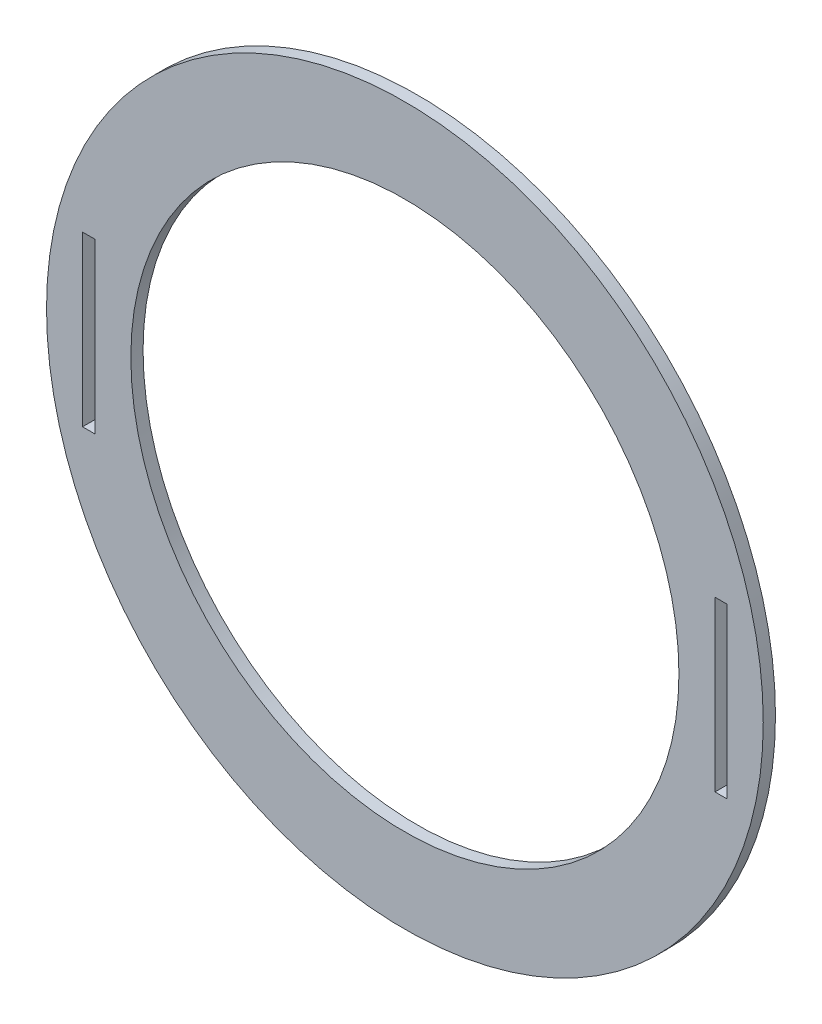
ISO-10303-21;
HEADER;
FILE_DESCRIPTION(('STEP AP214'),'2;1');
FILE_NAME('part.step','',(''),(''),'','','');
FILE_SCHEMA(('AUTOMOTIVE_DESIGN { 1 0 10303 214 1 1 1 1 }'));
ENDSEC;
DATA;
#1=APPLICATION_CONTEXT('core data for automotive mechanical design processes');
#2=APPLICATION_PROTOCOL_DEFINITION('international standard','automotive_design',2000,#1);
#3=PRODUCT_CONTEXT('',#1,'mechanical');
#4=PRODUCT('Part','Part','',(#3));
#5=PRODUCT_RELATED_PRODUCT_CATEGORY('part','',(#4));
#6=PRODUCT_DEFINITION_FORMATION('','',#4);
#7=PRODUCT_DEFINITION_CONTEXT('part definition',#1,'design');
#8=PRODUCT_DEFINITION('design','',#6,#7);
#9=PRODUCT_DEFINITION_SHAPE('','',#8);
#10=(LENGTH_UNIT() NAMED_UNIT(*) SI_UNIT(.MILLI.,.METRE.));
#11=(NAMED_UNIT(*) PLANE_ANGLE_UNIT() SI_UNIT($,.RADIAN.));
#12=(NAMED_UNIT(*) SI_UNIT($,.STERADIAN.) SOLID_ANGLE_UNIT());
#13=UNCERTAINTY_MEASURE_WITH_UNIT(LENGTH_MEASURE(1.E-05),#10,'distance_accuracy_value','');
#14=(GEOMETRIC_REPRESENTATION_CONTEXT(3) GLOBAL_UNCERTAINTY_ASSIGNED_CONTEXT((#13)) GLOBAL_UNIT_ASSIGNED_CONTEXT((#10,
#11,#12)) REPRESENTATION_CONTEXT('',''));
#15=CARTESIAN_POINT('',(0.,0.,0.));
#16=DIRECTION('',(0.,0.,1.));
#17=DIRECTION('',(1.,0.,0.));
#18=AXIS2_PLACEMENT_3D('',#15,#16,#17);
#19=CARTESIAN_POINT('',(0.,0.,2.9));
#20=DIRECTION('',(0.,0.,1.));
#21=DIRECTION('',(1.,0.,0.));
#22=AXIS2_PLACEMENT_3D('',#19,#20,#21);
#23=PLANE('',#22);
#24=CARTESIAN_POINT('',(0.,0.,2.9));
#25=DIRECTION('',(0.,0.,1.));
#26=DIRECTION('',(1.,0.,0.));
#27=AXIS2_PLACEMENT_3D('',#24,#25,#26);
#28=CIRCLE('',#27,85.);
#29=CARTESIAN_POINT('',(85.,0.,2.9));
#30=VERTEX_POINT('',#29);
#31=EDGE_CURVE('E11',#30,#30,#28,.T.);
#32=ORIENTED_EDGE('',*,*,#31,.T.);
#33=EDGE_LOOP('',(#32));
#34=FACE_BOUND('',#33,.T.);
#35=CARTESIAN_POINT('',(0.,0.,2.9));
#36=DIRECTION('',(0.,0.,1.));
#37=DIRECTION('',(1.,0.,0.));
#38=AXIS2_PLACEMENT_3D('',#35,#36,#37);
#39=CIRCLE('',#38,65.);
#40=CARTESIAN_POINT('',(65.,0.,2.9));
#41=VERTEX_POINT('',#40);
#42=EDGE_CURVE('E167',#41,#41,#39,.T.);
#43=ORIENTED_EDGE('',*,*,#42,.F.);
#44=EDGE_LOOP('',(#43));
#45=FACE_BOUND('',#44,.T.);
#46=DIRECTION('',(-1.,0.,0.));
#47=VECTOR('',#46,1.);
#48=CARTESIAN_POINT('',(-76.45,20.,2.9));
#49=LINE('',#48,#47);
#50=CARTESIAN_POINT('',(-73.55,20.,2.9));
#51=VERTEX_POINT('',#50);
#52=CARTESIAN_POINT('',(-76.45,20.,2.9));
#53=VERTEX_POINT('',#52);
#54=EDGE_CURVE('E138',#51,#53,#49,.T.);
#55=ORIENTED_EDGE('',*,*,#54,.F.);
#56=DIRECTION('',(0.,1.,0.));
#57=VECTOR('',#56,1.);
#58=CARTESIAN_POINT('',(-73.55,20.,2.9));
#59=LINE('',#58,#57);
#60=CARTESIAN_POINT('',(-73.55,-20.,2.9));
#61=VERTEX_POINT('',#60);
#62=EDGE_CURVE('E136',#61,#51,#59,.T.);
#63=ORIENTED_EDGE('',*,*,#62,.F.);
#64=DIRECTION('',(1.,0.,0.));
#65=VECTOR('',#64,1.);
#66=CARTESIAN_POINT('',(-76.45,-20.,2.9));
#67=LINE('',#66,#65);
#68=CARTESIAN_POINT('',(-76.45,-20.,2.9));
#69=VERTEX_POINT('',#68);
#70=EDGE_CURVE('E144',#69,#61,#67,.T.);
#71=ORIENTED_EDGE('',*,*,#70,.F.);
#72=DIRECTION('',(0.,-1.,0.));
#73=VECTOR('',#72,1.);
#74=CARTESIAN_POINT('',(-76.45,20.,2.9));
#75=LINE('',#74,#73);
#76=EDGE_CURVE('E141',#53,#69,#75,.T.);
#77=ORIENTED_EDGE('',*,*,#76,.F.);
#78=EDGE_LOOP('',(#55,#63,#71,#77));
#79=FACE_BOUND('',#78,.T.);
#80=DIRECTION('',(-1.,0.,0.));
#81=VECTOR('',#80,1.);
#82=CARTESIAN_POINT('',(76.45,20.,2.9));
#83=LINE('',#82,#81);
#84=CARTESIAN_POINT('',(76.45,20.,2.9));
#85=VERTEX_POINT('',#84);
#86=CARTESIAN_POINT('',(73.55,20.,2.9));
#87=VERTEX_POINT('',#86);
#88=EDGE_CURVE('E108',#85,#87,#83,.T.);
#89=ORIENTED_EDGE('',*,*,#88,.F.);
#90=DIRECTION('',(0.,1.,0.));
#91=VECTOR('',#90,1.);
#92=CARTESIAN_POINT('',(76.45,20.,2.9));
#93=LINE('',#92,#91);
#94=CARTESIAN_POINT('',(76.45,-20.,2.9));
#95=VERTEX_POINT('',#94);
#96=EDGE_CURVE('E100',#95,#85,#93,.T.);
#97=ORIENTED_EDGE('',*,*,#96,.F.);
#98=DIRECTION('',(1.,0.,0.));
#99=VECTOR('',#98,1.);
#100=CARTESIAN_POINT('',(76.45,-20.,2.9));
#101=LINE('',#100,#99);
#102=CARTESIAN_POINT('',(73.55,-20.,2.9));
#103=VERTEX_POINT('',#102);
#104=EDGE_CURVE('E122',#103,#95,#101,.T.);
#105=ORIENTED_EDGE('',*,*,#104,.F.);
#106=DIRECTION('',(0.,-1.,0.));
#107=VECTOR('',#106,1.);
#108=CARTESIAN_POINT('',(73.55,20.,2.9));
#109=LINE('',#108,#107);
#110=EDGE_CURVE('E120',#87,#103,#109,.T.);
#111=ORIENTED_EDGE('',*,*,#110,.F.);
#112=EDGE_LOOP('',(#89,#97,#105,#111));
#113=FACE_BOUND('',#112,.T.);
#114=ADVANCED_FACE('F35',(#34,#45,#79,#113),#23,.T.);
#115=CARTESIAN_POINT('',(0.,0.,0.));
#116=DIRECTION('',(0.,0.,1.));
#117=DIRECTION('',(1.,0.,0.));
#118=AXIS2_PLACEMENT_3D('',#115,#116,#117);
#119=PLANE('',#118);
#120=DIRECTION('',(0.,1.,0.));
#121=VECTOR('',#120,1.);
#122=CARTESIAN_POINT('',(-73.55,20.,0.));
#123=LINE('',#122,#121);
#124=CARTESIAN_POINT('',(-73.55,-20.,0.));
#125=VERTEX_POINT('',#124);
#126=CARTESIAN_POINT('',(-73.55,20.,0.));
#127=VERTEX_POINT('',#126);
#128=EDGE_CURVE('E116',#125,#127,#123,.T.);
#129=ORIENTED_EDGE('',*,*,#128,.T.);
#130=DIRECTION('',(-1.,0.,0.));
#131=VECTOR('',#130,1.);
#132=CARTESIAN_POINT('',(-76.45,20.,0.));
#133=LINE('',#132,#131);
#134=CARTESIAN_POINT('',(-76.45,20.,0.));
#135=VERTEX_POINT('',#134);
#136=EDGE_CURVE('E149',#127,#135,#133,.T.);
#137=ORIENTED_EDGE('',*,*,#136,.T.);
#138=DIRECTION('',(0.,-1.,0.));
#139=VECTOR('',#138,1.);
#140=CARTESIAN_POINT('',(-76.45,20.,0.));
#141=LINE('',#140,#139);
#142=CARTESIAN_POINT('',(-76.45,-20.,0.));
#143=VERTEX_POINT('',#142);
#144=EDGE_CURVE('E152',#135,#143,#141,.T.);
#145=ORIENTED_EDGE('',*,*,#144,.T.);
#146=DIRECTION('',(1.,0.,0.));
#147=VECTOR('',#146,1.);
#148=CARTESIAN_POINT('',(-76.45,-20.,0.));
#149=LINE('',#148,#147);
#150=EDGE_CURVE('E139',#143,#125,#149,.T.);
#151=ORIENTED_EDGE('',*,*,#150,.T.);
#152=EDGE_LOOP('',(#129,#137,#145,#151));
#153=FACE_BOUND('',#152,.T.);
#154=CARTESIAN_POINT('',(0.,0.,0.));
#155=DIRECTION('',(0.,0.,1.));
#156=DIRECTION('',(1.,0.,0.));
#157=AXIS2_PLACEMENT_3D('',#154,#155,#156);
#158=CIRCLE('',#157,85.);
#159=CARTESIAN_POINT('',(85.,0.,0.));
#160=VERTEX_POINT('',#159);
#161=EDGE_CURVE('E39',#160,#160,#158,.T.);
#162=ORIENTED_EDGE('',*,*,#161,.F.);
#163=EDGE_LOOP('',(#162));
#164=FACE_BOUND('',#163,.T.);
#165=CARTESIAN_POINT('',(0.,0.,0.));
#166=DIRECTION('',(0.,0.,1.));
#167=DIRECTION('',(1.,0.,0.));
#168=AXIS2_PLACEMENT_3D('',#165,#166,#167);
#169=CIRCLE('',#168,65.);
#170=CARTESIAN_POINT('',(65.,0.,0.));
#171=VERTEX_POINT('',#170);
#172=EDGE_CURVE('E166',#171,#171,#169,.T.);
#173=ORIENTED_EDGE('',*,*,#172,.T.);
#174=EDGE_LOOP('',(#173));
#175=FACE_BOUND('',#174,.T.);
#176=DIRECTION('',(0.,1.,0.));
#177=VECTOR('',#176,1.);
#178=CARTESIAN_POINT('',(76.45,20.,0.));
#179=LINE('',#178,#177);
#180=CARTESIAN_POINT('',(76.45,-20.,0.));
#181=VERTEX_POINT('',#180);
#182=CARTESIAN_POINT('',(76.45,20.,0.));
#183=VERTEX_POINT('',#182);
#184=EDGE_CURVE('E58',#181,#183,#179,.T.);
#185=ORIENTED_EDGE('',*,*,#184,.T.);
#186=DIRECTION('',(-1.,0.,0.));
#187=VECTOR('',#186,1.);
#188=CARTESIAN_POINT('',(76.45,20.,0.));
#189=LINE('',#188,#187);
#190=CARTESIAN_POINT('',(73.55,20.,0.));
#191=VERTEX_POINT('',#190);
#192=EDGE_CURVE('E115',#183,#191,#189,.T.);
#193=ORIENTED_EDGE('',*,*,#192,.T.);
#194=DIRECTION('',(0.,-1.,0.));
#195=VECTOR('',#194,1.);
#196=CARTESIAN_POINT('',(73.55,20.,0.));
#197=LINE('',#196,#195);
#198=CARTESIAN_POINT('',(73.55,-20.,0.));
#199=VERTEX_POINT('',#198);
#200=EDGE_CURVE('E128',#191,#199,#197,.T.);
#201=ORIENTED_EDGE('',*,*,#200,.T.);
#202=DIRECTION('',(1.,0.,0.));
#203=VECTOR('',#202,1.);
#204=CARTESIAN_POINT('',(76.45,-20.,0.));
#205=LINE('',#204,#203);
#206=EDGE_CURVE('E109',#199,#181,#205,.T.);
#207=ORIENTED_EDGE('',*,*,#206,.T.);
#208=EDGE_LOOP('',(#185,#193,#201,#207));
#209=FACE_BOUND('',#208,.T.);
#210=ADVANCED_FACE('F173',(#153,#164,#175,#209),#119,.F.);
#211=CARTESIAN_POINT('',(0.,0.,2.9));
#212=DIRECTION('',(0.,0.,-1.));
#213=DIRECTION('',(-1.,0.,0.));
#214=AXIS2_PLACEMENT_3D('',#211,#212,#213);
#215=CYLINDRICAL_SURFACE('',#214,85.);
#216=ORIENTED_EDGE('',*,*,#31,.F.);
#217=EDGE_LOOP('',(#216));
#218=FACE_BOUND('',#217,.T.);
#219=ORIENTED_EDGE('',*,*,#161,.T.);
#220=EDGE_LOOP('',(#219));
#221=FACE_BOUND('',#220,.T.);
#222=ADVANCED_FACE('F37',(#218,#221),#215,.T.);
#223=CARTESIAN_POINT('',(0.,0.,2.9));
#224=DIRECTION('',(0.,0.,-1.));
#225=DIRECTION('',(-1.,0.,0.));
#226=AXIS2_PLACEMENT_3D('',#223,#224,#225);
#227=CYLINDRICAL_SURFACE('',#226,65.);
#228=ORIENTED_EDGE('',*,*,#42,.T.);
#229=EDGE_LOOP('',(#228));
#230=FACE_BOUND('',#229,.T.);
#231=ORIENTED_EDGE('',*,*,#172,.F.);
#232=EDGE_LOOP('',(#231));
#233=FACE_BOUND('',#232,.T.);
#234=ADVANCED_FACE('F176',(#230,#233),#227,.F.);
#235=CARTESIAN_POINT('',(-73.55,20.,2.9));
#236=DIRECTION('',(-1.,0.,0.));
#237=DIRECTION('',(0.,0.,1.));
#238=AXIS2_PLACEMENT_3D('',#235,#236,#237);
#239=PLANE('',#238);
#240=ORIENTED_EDGE('',*,*,#128,.F.);
#241=DIRECTION('',(0.,0.,-1.));
#242=VECTOR('',#241,1.);
#243=CARTESIAN_POINT('',(-73.55,-20.,2.9));
#244=LINE('',#243,#242);
#245=EDGE_CURVE('E146',#61,#125,#244,.T.);
#246=ORIENTED_EDGE('',*,*,#245,.F.);
#247=ORIENTED_EDGE('',*,*,#62,.T.);
#248=DIRECTION('',(0.,0.,-1.));
#249=VECTOR('',#248,1.);
#250=CARTESIAN_POINT('',(-73.55,20.,2.9));
#251=LINE('',#250,#249);
#252=EDGE_CURVE('E163',#51,#127,#251,.T.);
#253=ORIENTED_EDGE('',*,*,#252,.T.);
#254=EDGE_LOOP('',(#240,#246,#247,#253));
#255=FACE_BOUND('',#254,.T.);
#256=ADVANCED_FACE('F178',(#255),#239,.T.);
#257=CARTESIAN_POINT('',(-76.45,20.,2.9));
#258=DIRECTION('',(0.,-1.,0.));
#259=DIRECTION('',(0.,0.,-1.));
#260=AXIS2_PLACEMENT_3D('',#257,#258,#259);
#261=PLANE('',#260);
#262=ORIENTED_EDGE('',*,*,#136,.F.);
#263=ORIENTED_EDGE('',*,*,#252,.F.);
#264=ORIENTED_EDGE('',*,*,#54,.T.);
#265=DIRECTION('',(0.,0.,-1.));
#266=VECTOR('',#265,1.);
#267=CARTESIAN_POINT('',(-76.45,20.,2.9));
#268=LINE('',#267,#266);
#269=EDGE_CURVE('E161',#53,#135,#268,.T.);
#270=ORIENTED_EDGE('',*,*,#269,.T.);
#271=EDGE_LOOP('',(#262,#263,#264,#270));
#272=FACE_BOUND('',#271,.T.);
#273=ADVANCED_FACE('F185',(#272),#261,.T.);
#274=CARTESIAN_POINT('',(-76.45,20.,2.9));
#275=DIRECTION('',(1.,0.,0.));
#276=DIRECTION('',(0.,0.,-1.));
#277=AXIS2_PLACEMENT_3D('',#274,#275,#276);
#278=PLANE('',#277);
#279=ORIENTED_EDGE('',*,*,#144,.F.);
#280=ORIENTED_EDGE('',*,*,#269,.F.);
#281=ORIENTED_EDGE('',*,*,#76,.T.);
#282=DIRECTION('',(0.,0.,-1.));
#283=VECTOR('',#282,1.);
#284=CARTESIAN_POINT('',(-76.45,-20.,2.9));
#285=LINE('',#284,#283);
#286=EDGE_CURVE('E159',#69,#143,#285,.T.);
#287=ORIENTED_EDGE('',*,*,#286,.T.);
#288=EDGE_LOOP('',(#279,#280,#281,#287));
#289=FACE_BOUND('',#288,.T.);
#290=ADVANCED_FACE('F209',(#289),#278,.T.);
#291=CARTESIAN_POINT('',(-76.45,-20.,2.9));
#292=DIRECTION('',(0.,1.,0.));
#293=DIRECTION('',(0.,0.,1.));
#294=AXIS2_PLACEMENT_3D('',#291,#292,#293);
#295=PLANE('',#294);
#296=ORIENTED_EDGE('',*,*,#150,.F.);
#297=ORIENTED_EDGE('',*,*,#286,.F.);
#298=ORIENTED_EDGE('',*,*,#70,.T.);
#299=ORIENTED_EDGE('',*,*,#245,.T.);
#300=EDGE_LOOP('',(#296,#297,#298,#299));
#301=FACE_BOUND('',#300,.T.);
#302=ADVANCED_FACE('F214',(#301),#295,.T.);
#303=CARTESIAN_POINT('',(76.45,20.,2.9));
#304=DIRECTION('',(-1.,0.,0.));
#305=DIRECTION('',(0.,0.,1.));
#306=AXIS2_PLACEMENT_3D('',#303,#304,#305);
#307=PLANE('',#306);
#308=ORIENTED_EDGE('',*,*,#184,.F.);
#309=DIRECTION('',(0.,0.,-1.));
#310=VECTOR('',#309,1.);
#311=CARTESIAN_POINT('',(76.45,-20.,2.9));
#312=LINE('',#311,#310);
#313=EDGE_CURVE('E104',#95,#181,#312,.T.);
#314=ORIENTED_EDGE('',*,*,#313,.F.);
#315=ORIENTED_EDGE('',*,*,#96,.T.);
#316=DIRECTION('',(0.,0.,-1.));
#317=VECTOR('',#316,1.);
#318=CARTESIAN_POINT('',(76.45,20.,2.9));
#319=LINE('',#318,#317);
#320=EDGE_CURVE('E103',#85,#183,#319,.T.);
#321=ORIENTED_EDGE('',*,*,#320,.T.);
#322=EDGE_LOOP('',(#308,#314,#315,#321));
#323=FACE_BOUND('',#322,.T.);
#324=ADVANCED_FACE('F102',(#323),#307,.T.);
#325=CARTESIAN_POINT('',(76.45,20.,2.9));
#326=DIRECTION('',(0.,-1.,0.));
#327=DIRECTION('',(0.,0.,-1.));
#328=AXIS2_PLACEMENT_3D('',#325,#326,#327);
#329=PLANE('',#328);
#330=ORIENTED_EDGE('',*,*,#192,.F.);
#331=ORIENTED_EDGE('',*,*,#320,.F.);
#332=ORIENTED_EDGE('',*,*,#88,.T.);
#333=DIRECTION('',(0.,0.,-1.));
#334=VECTOR('',#333,1.);
#335=CARTESIAN_POINT('',(73.55,20.,2.9));
#336=LINE('',#335,#334);
#337=EDGE_CURVE('E117',#87,#191,#336,.T.);
#338=ORIENTED_EDGE('',*,*,#337,.T.);
#339=EDGE_LOOP('',(#330,#331,#332,#338));
#340=FACE_BOUND('',#339,.T.);
#341=ADVANCED_FACE('F112',(#340),#329,.T.);
#342=CARTESIAN_POINT('',(73.55,20.,2.9));
#343=DIRECTION('',(1.,0.,0.));
#344=DIRECTION('',(0.,0.,-1.));
#345=AXIS2_PLACEMENT_3D('',#342,#343,#344);
#346=PLANE('',#345);
#347=ORIENTED_EDGE('',*,*,#200,.F.);
#348=ORIENTED_EDGE('',*,*,#337,.F.);
#349=ORIENTED_EDGE('',*,*,#110,.T.);
#350=DIRECTION('',(0.,0.,-1.));
#351=VECTOR('',#350,1.);
#352=CARTESIAN_POINT('',(73.55,-20.,2.9));
#353=LINE('',#352,#351);
#354=EDGE_CURVE('E50',#103,#199,#353,.T.);
#355=ORIENTED_EDGE('',*,*,#354,.T.);
#356=EDGE_LOOP('',(#347,#348,#349,#355));
#357=FACE_BOUND('',#356,.T.);
#358=ADVANCED_FACE('F253',(#357),#346,.T.);
#359=CARTESIAN_POINT('',(76.45,-20.,2.9));
#360=DIRECTION('',(0.,1.,0.));
#361=DIRECTION('',(0.,0.,1.));
#362=AXIS2_PLACEMENT_3D('',#359,#360,#361);
#363=PLANE('',#362);
#364=ORIENTED_EDGE('',*,*,#206,.F.);
#365=ORIENTED_EDGE('',*,*,#354,.F.);
#366=ORIENTED_EDGE('',*,*,#104,.T.);
#367=ORIENTED_EDGE('',*,*,#313,.T.);
#368=EDGE_LOOP('',(#364,#365,#366,#367));
#369=FACE_BOUND('',#368,.T.);
#370=ADVANCED_FACE('F261',(#369),#363,.T.);
#371=CLOSED_SHELL('',(#114,#210,#222,#234,#256,#273,#290,#302,#324,#341,#358,#370));
#372=MANIFOLD_SOLID_BREP('B2',#371);
#373=ADVANCED_BREP_SHAPE_REPRESENTATION('',(#18,#372),#14);
#374=SHAPE_DEFINITION_REPRESENTATION(#9,#373);
ENDSEC;
END-ISO-10303-21;
